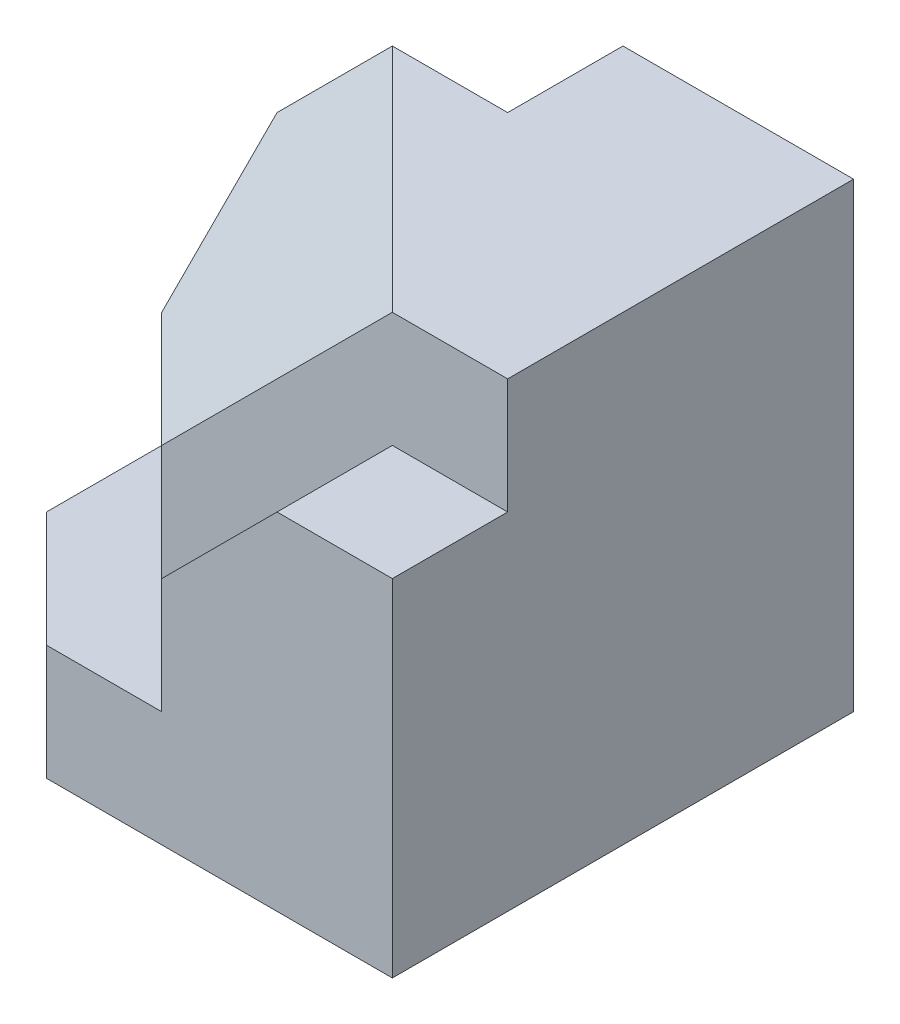
ISO-10303-21;
HEADER;
FILE_DESCRIPTION(('STEP AP214'),'2;1');
FILE_NAME('part.step','',(''),(''),'','','');
FILE_SCHEMA(('AUTOMOTIVE_DESIGN { 1 0 10303 214 1 1 1 1 }'));
ENDSEC;
DATA;
#1=APPLICATION_CONTEXT('core data for automotive mechanical design processes');
#2=APPLICATION_PROTOCOL_DEFINITION('international standard','automotive_design',2000,#1);
#3=PRODUCT_CONTEXT('',#1,'mechanical');
#4=PRODUCT('Part','Part','',(#3));
#5=PRODUCT_RELATED_PRODUCT_CATEGORY('part','',(#4));
#6=PRODUCT_DEFINITION_FORMATION('','',#4);
#7=PRODUCT_DEFINITION_CONTEXT('part definition',#1,'design');
#8=PRODUCT_DEFINITION('design','',#6,#7);
#9=PRODUCT_DEFINITION_SHAPE('','',#8);
#10=(LENGTH_UNIT() NAMED_UNIT(*) SI_UNIT(.MILLI.,.METRE.));
#11=(NAMED_UNIT(*) PLANE_ANGLE_UNIT() SI_UNIT($,.RADIAN.));
#12=(NAMED_UNIT(*) SI_UNIT($,.STERADIAN.) SOLID_ANGLE_UNIT());
#13=UNCERTAINTY_MEASURE_WITH_UNIT(LENGTH_MEASURE(1.E-05),#10,'distance_accuracy_value','');
#14=(GEOMETRIC_REPRESENTATION_CONTEXT(3) GLOBAL_UNCERTAINTY_ASSIGNED_CONTEXT((#13)) GLOBAL_UNIT_ASSIGNED_CONTEXT((#10,
#11,#12)) REPRESENTATION_CONTEXT('',''));
#15=CARTESIAN_POINT('',(0.,0.,0.));
#16=DIRECTION('',(0.,0.,1.));
#17=DIRECTION('',(1.,0.,0.));
#18=AXIS2_PLACEMENT_3D('',#15,#16,#17);
#19=CARTESIAN_POINT('',(-15.,20.,5.));
#20=DIRECTION('',(0.,0.,1.));
#21=DIRECTION('',(1.,0.,0.));
#22=AXIS2_PLACEMENT_3D('',#19,#20,#21);
#23=PLANE('',#22);
#24=DIRECTION('',(1.,0.,0.));
#25=VECTOR('',#24,1.);
#26=CARTESIAN_POINT('',(-20.,15.,5.));
#27=LINE('',#26,#25);
#28=CARTESIAN_POINT('',(-20.,15.,5.));
#29=VERTEX_POINT('',#28);
#30=CARTESIAN_POINT('',(-10.,15.,5.));
#31=VERTEX_POINT('',#30);
#32=EDGE_CURVE('E173',#29,#31,#27,.T.);
#33=ORIENTED_EDGE('',*,*,#32,.F.);
#34=DIRECTION('',(0.707106781186548,0.707106781186548,0.));
#35=VECTOR('',#34,1.);
#36=CARTESIAN_POINT('',(-20.,15.,5.));
#37=LINE('',#36,#35);
#38=CARTESIAN_POINT('',(-15.,20.,5.));
#39=VERTEX_POINT('',#38);
#40=EDGE_CURVE('E149',#29,#39,#37,.T.);
#41=ORIENTED_EDGE('',*,*,#40,.T.);
#42=DIRECTION('',(-1.,0.,0.));
#43=VECTOR('',#42,1.);
#44=CARTESIAN_POINT('',(-15.,20.,5.));
#45=LINE('',#44,#43);
#46=CARTESIAN_POINT('',(-10.,20.,5.));
#47=VERTEX_POINT('',#46);
#48=EDGE_CURVE('E159',#47,#39,#45,.T.);
#49=ORIENTED_EDGE('',*,*,#48,.F.);
#50=DIRECTION('',(0.,-1.,0.));
#51=VECTOR('',#50,1.);
#52=CARTESIAN_POINT('',(-10.,20.,5.));
#53=LINE('',#52,#51);
#54=EDGE_CURVE('E233',#47,#31,#53,.T.);
#55=ORIENTED_EDGE('',*,*,#54,.T.);
#56=EDGE_LOOP('',(#33,#41,#49,#55));
#57=FACE_BOUND('',#56,.T.);
#58=ADVANCED_FACE('F34',(#57),#23,.F.);
#59=CARTESIAN_POINT('',(-10.,20.,5.));
#60=DIRECTION('',(1.,0.,0.));
#61=DIRECTION('',(0.,0.,-1.));
#62=AXIS2_PLACEMENT_3D('',#59,#60,#61);
#63=PLANE('',#62);
#64=DIRECTION('',(0.,0.,-1.));
#65=VECTOR('',#64,1.);
#66=CARTESIAN_POINT('',(-10.,15.,0.));
#67=LINE('',#66,#65);
#68=CARTESIAN_POINT('',(-10.,15.,0.));
#69=VERTEX_POINT('',#68);
#70=EDGE_CURVE('E54',#31,#69,#67,.T.);
#71=ORIENTED_EDGE('',*,*,#70,.F.);
#72=ORIENTED_EDGE('',*,*,#54,.F.);
#73=DIRECTION('',(0.,0.,1.));
#74=VECTOR('',#73,1.);
#75=CARTESIAN_POINT('',(-10.,20.,5.));
#76=LINE('',#75,#74);
#77=CARTESIAN_POINT('',(-10.,20.,0.));
#78=VERTEX_POINT('',#77);
#79=EDGE_CURVE('E283',#78,#47,#76,.T.);
#80=ORIENTED_EDGE('',*,*,#79,.F.);
#81=DIRECTION('',(0.,-1.,0.));
#82=VECTOR('',#81,1.);
#83=CARTESIAN_POINT('',(-10.,20.,0.));
#84=LINE('',#83,#82);
#85=EDGE_CURVE('E50',#78,#69,#84,.T.);
#86=ORIENTED_EDGE('',*,*,#85,.T.);
#87=EDGE_LOOP('',(#71,#72,#80,#86));
#88=FACE_BOUND('',#87,.T.);
#89=ADVANCED_FACE('F332',(#88),#63,.F.);
#90=CARTESIAN_POINT('',(-15.,20.,15.));
#91=DIRECTION('',(-0.707106781186548,0.,0.707106781186547));
#92=DIRECTION('',(0.707106781186547,0.,0.707106781186548));
#93=AXIS2_PLACEMENT_3D('',#90,#91,#92);
#94=PLANE('',#93);
#95=DIRECTION('',(0.,-1.,0.));
#96=VECTOR('',#95,1.);
#97=CARTESIAN_POINT('',(-20.,20.,10.));
#98=LINE('',#97,#96);
#99=CARTESIAN_POINT('',(-20.,10.,10.));
#100=VERTEX_POINT('',#99);
#101=CARTESIAN_POINT('',(-20.,5.,10.));
#102=VERTEX_POINT('',#101);
#103=EDGE_CURVE('E242',#100,#102,#98,.T.);
#104=ORIENTED_EDGE('',*,*,#103,.T.);
#105=DIRECTION('',(0.707106781186547,0.,0.707106781186548));
#106=VECTOR('',#105,1.);
#107=CARTESIAN_POINT('',(-20.,5.,10.));
#108=LINE('',#107,#106);
#109=CARTESIAN_POINT('',(-15.,5.,15.));
#110=VERTEX_POINT('',#109);
#111=EDGE_CURVE('E177',#102,#110,#108,.T.);
#112=ORIENTED_EDGE('',*,*,#111,.T.);
#113=DIRECTION('',(0.,-1.,0.));
#114=VECTOR('',#113,1.);
#115=CARTESIAN_POINT('',(-15.,20.,15.));
#116=LINE('',#115,#114);
#117=CARTESIAN_POINT('',(-15.,10.,15.));
#118=VERTEX_POINT('',#117);
#119=EDGE_CURVE('E148',#118,#110,#116,.T.);
#120=ORIENTED_EDGE('',*,*,#119,.F.);
#121=DIRECTION('',(-0.707106781186547,0.,-0.707106781186548));
#122=VECTOR('',#121,1.);
#123=CARTESIAN_POINT('',(-15.,10.,15.));
#124=LINE('',#123,#122);
#125=EDGE_CURVE('E243',#118,#100,#124,.T.);
#126=ORIENTED_EDGE('',*,*,#125,.T.);
#127=EDGE_LOOP('',(#104,#112,#120,#126));
#128=FACE_BOUND('',#127,.T.);
#129=ADVANCED_FACE('F320',(#128),#94,.T.);
#130=CARTESIAN_POINT('',(0.,20.,15.));
#131=DIRECTION('',(0.,0.,-1.));
#132=DIRECTION('',(-1.,0.,0.));
#133=AXIS2_PLACEMENT_3D('',#130,#131,#132);
#134=PLANE('',#133);
#135=DIRECTION('',(-1.,0.,0.));
#136=VECTOR('',#135,1.);
#137=CARTESIAN_POINT('',(-9.99999999999999,5.,15.));
#138=LINE('',#137,#136);
#139=CARTESIAN_POINT('',(-9.99999999999999,5.,15.));
#140=VERTEX_POINT('',#139);
#141=EDGE_CURVE('E189',#140,#110,#138,.T.);
#142=ORIENTED_EDGE('',*,*,#141,.F.);
#143=DIRECTION('',(0.,-1.,0.));
#144=VECTOR('',#143,1.);
#145=CARTESIAN_POINT('',(-9.99999999999999,10.,15.));
#146=LINE('',#145,#144);
#147=CARTESIAN_POINT('',(-9.99999999999999,10.,15.));
#148=VERTEX_POINT('',#147);
#149=EDGE_CURVE('E208',#148,#140,#146,.T.);
#150=ORIENTED_EDGE('',*,*,#149,.F.);
#151=DIRECTION('',(-0.707106781186548,-0.707106781186547,0.));
#152=VECTOR('',#151,1.);
#153=CARTESIAN_POINT('',(-5.,15.,15.));
#154=LINE('',#153,#152);
#155=CARTESIAN_POINT('',(-5.,15.,15.));
#156=VERTEX_POINT('',#155);
#157=EDGE_CURVE('E205',#156,#148,#154,.T.);
#158=ORIENTED_EDGE('',*,*,#157,.F.);
#159=DIRECTION('',(-1.,0.,0.));
#160=VECTOR('',#159,1.);
#161=CARTESIAN_POINT('',(0.,15.,15.));
#162=LINE('',#161,#160);
#163=CARTESIAN_POINT('',(0.,15.,15.));
#164=VERTEX_POINT('',#163);
#165=EDGE_CURVE('E184',#164,#156,#162,.T.);
#166=ORIENTED_EDGE('',*,*,#165,.F.);
#167=DIRECTION('',(0.,-1.,0.));
#168=VECTOR('',#167,1.);
#169=CARTESIAN_POINT('',(0.,20.,15.));
#170=LINE('',#169,#168);
#171=CARTESIAN_POINT('',(0.,20.,15.));
#172=VERTEX_POINT('',#171);
#173=EDGE_CURVE('E12',#172,#164,#170,.T.);
#174=ORIENTED_EDGE('',*,*,#173,.F.);
#175=DIRECTION('',(1.,0.,0.));
#176=VECTOR('',#175,1.);
#177=CARTESIAN_POINT('',(0.,20.,15.));
#178=LINE('',#177,#176);
#179=CARTESIAN_POINT('',(-5.,20.,15.));
#180=VERTEX_POINT('',#179);
#181=EDGE_CURVE('E274',#180,#172,#178,.T.);
#182=ORIENTED_EDGE('',*,*,#181,.F.);
#183=DIRECTION('',(-0.707106781186548,-0.707106781186547,0.));
#184=VECTOR('',#183,1.);
#185=CARTESIAN_POINT('',(-5.,20.,15.));
#186=LINE('',#185,#184);
#187=EDGE_CURVE('E246',#180,#118,#186,.T.);
#188=ORIENTED_EDGE('',*,*,#187,.T.);
#189=ORIENTED_EDGE('',*,*,#119,.T.);
#190=EDGE_LOOP('',(#142,#150,#158,#166,#174,#182,#188,#189));
#191=FACE_BOUND('',#190,.T.);
#192=ADVANCED_FACE('F315',(#191),#134,.F.);
#193=CARTESIAN_POINT('',(0.,20.,0.));
#194=DIRECTION('',(0.,1.,0.));
#195=DIRECTION('',(0.,0.,1.));
#196=AXIS2_PLACEMENT_3D('',#193,#194,#195);
#197=PLANE('',#196);
#198=ORIENTED_EDGE('',*,*,#48,.T.);
#199=DIRECTION('',(0.707106781186548,0.,0.707106781186548));
#200=VECTOR('',#199,1.);
#201=CARTESIAN_POINT('',(-15.,20.,5.));
#202=LINE('',#201,#200);
#203=EDGE_CURVE('E239',#39,#180,#202,.T.);
#204=ORIENTED_EDGE('',*,*,#203,.T.);
#205=ORIENTED_EDGE('',*,*,#181,.T.);
#206=DIRECTION('',(0.,0.,-1.));
#207=VECTOR('',#206,1.);
#208=CARTESIAN_POINT('',(0.,20.,0.));
#209=LINE('',#208,#207);
#210=CARTESIAN_POINT('',(0.,20.,0.));
#211=VERTEX_POINT('',#210);
#212=EDGE_CURVE('E279',#172,#211,#209,.T.);
#213=ORIENTED_EDGE('',*,*,#212,.T.);
#214=DIRECTION('',(-1.,0.,0.));
#215=VECTOR('',#214,1.);
#216=CARTESIAN_POINT('',(-10.,20.,0.));
#217=LINE('',#216,#215);
#218=EDGE_CURVE('E281',#211,#78,#217,.T.);
#219=ORIENTED_EDGE('',*,*,#218,.T.);
#220=ORIENTED_EDGE('',*,*,#79,.T.);
#221=EDGE_LOOP('',(#198,#204,#205,#213,#219,#220));
#222=FACE_BOUND('',#221,.T.);
#223=ADVANCED_FACE('F331',(#222),#197,.T.);
#224=CARTESIAN_POINT('',(-20.,20.,10.));
#225=DIRECTION('',(-1.,0.,0.));
#226=DIRECTION('',(0.,0.,1.));
#227=AXIS2_PLACEMENT_3D('',#224,#225,#226);
#228=PLANE('',#227);
#229=ORIENTED_EDGE('',*,*,#103,.F.);
#230=DIRECTION('',(0.,0.707106781186548,-0.707106781186548));
#231=VECTOR('',#230,1.);
#232=CARTESIAN_POINT('',(-20.,10.,10.));
#233=LINE('',#232,#231);
#234=EDGE_CURVE('E236',#100,#29,#233,.T.);
#235=ORIENTED_EDGE('',*,*,#234,.T.);
#236=DIRECTION('',(0.,0.,-1.));
#237=VECTOR('',#236,1.);
#238=CARTESIAN_POINT('',(-20.,15.,0.));
#239=LINE('',#238,#237);
#240=CARTESIAN_POINT('',(-20.,15.,0.));
#241=VERTEX_POINT('',#240);
#242=EDGE_CURVE('E166',#29,#241,#239,.T.);
#243=ORIENTED_EDGE('',*,*,#242,.T.);
#244=DIRECTION('',(0.,-1.,0.));
#245=VECTOR('',#244,1.);
#246=CARTESIAN_POINT('',(-20.,0.,0.));
#247=LINE('',#246,#245);
#248=CARTESIAN_POINT('',(-20.,0.,0.));
#249=VERTEX_POINT('',#248);
#250=EDGE_CURVE('E156',#241,#249,#247,.T.);
#251=ORIENTED_EDGE('',*,*,#250,.T.);
#252=DIRECTION('',(0.,0.,-1.));
#253=VECTOR('',#252,1.);
#254=CARTESIAN_POINT('',(-20.,0.,10.));
#255=LINE('',#254,#253);
#256=CARTESIAN_POINT('',(-20.,0.,15.));
#257=VERTEX_POINT('',#256);
#258=EDGE_CURVE('E139',#257,#249,#255,.T.);
#259=ORIENTED_EDGE('',*,*,#258,.F.);
#260=DIRECTION('',(0.,-1.,0.));
#261=VECTOR('',#260,1.);
#262=CARTESIAN_POINT('',(-20.,5.,15.));
#263=LINE('',#262,#261);
#264=CARTESIAN_POINT('',(-20.,5.,15.));
#265=VERTEX_POINT('',#264);
#266=EDGE_CURVE('E181',#265,#257,#263,.T.);
#267=ORIENTED_EDGE('',*,*,#266,.F.);
#268=DIRECTION('',(0.,0.,-1.));
#269=VECTOR('',#268,1.);
#270=CARTESIAN_POINT('',(-20.,5.,15.));
#271=LINE('',#270,#269);
#272=EDGE_CURVE('E174',#265,#102,#271,.T.);
#273=ORIENTED_EDGE('',*,*,#272,.T.);
#274=EDGE_LOOP('',(#229,#235,#243,#251,#259,#267,#273));
#275=FACE_BOUND('',#274,.T.);
#276=ADVANCED_FACE('F163',(#275),#228,.T.);
#277=CARTESIAN_POINT('',(0.,20.,0.));
#278=DIRECTION('',(-1.,0.,0.));
#279=DIRECTION('',(0.,0.,1.));
#280=AXIS2_PLACEMENT_3D('',#277,#278,#279);
#281=PLANE('',#280);
#282=DIRECTION('',(0.,0.,-1.));
#283=VECTOR('',#282,1.);
#284=CARTESIAN_POINT('',(0.,0.,0.));
#285=LINE('',#284,#283);
#286=CARTESIAN_POINT('',(0.,0.,20.));
#287=VERTEX_POINT('',#286);
#288=CARTESIAN_POINT('',(0.,0.,0.));
#289=VERTEX_POINT('',#288);
#290=EDGE_CURVE('E160',#287,#289,#285,.T.);
#291=ORIENTED_EDGE('',*,*,#290,.T.);
#292=DIRECTION('',(0.,-1.,0.));
#293=VECTOR('',#292,1.);
#294=CARTESIAN_POINT('',(0.,20.,0.));
#295=LINE('',#294,#293);
#296=EDGE_CURVE('E42',#211,#289,#295,.T.);
#297=ORIENTED_EDGE('',*,*,#296,.F.);
#298=ORIENTED_EDGE('',*,*,#212,.F.);
#299=ORIENTED_EDGE('',*,*,#173,.T.);
#300=DIRECTION('',(0.,0.,-1.));
#301=VECTOR('',#300,1.);
#302=CARTESIAN_POINT('',(0.,15.,20.));
#303=LINE('',#302,#301);
#304=CARTESIAN_POINT('',(0.,15.,20.));
#305=VERTEX_POINT('',#304);
#306=EDGE_CURVE('E244',#305,#164,#303,.T.);
#307=ORIENTED_EDGE('',*,*,#306,.F.);
#308=DIRECTION('',(0.,1.,0.));
#309=VECTOR('',#308,1.);
#310=CARTESIAN_POINT('',(0.,0.,20.));
#311=LINE('',#310,#309);
#312=EDGE_CURVE('E185',#287,#305,#311,.T.);
#313=ORIENTED_EDGE('',*,*,#312,.F.);
#314=EDGE_LOOP('',(#291,#297,#298,#299,#307,#313));
#315=FACE_BOUND('',#314,.T.);
#316=ADVANCED_FACE('F328',(#315),#281,.F.);
#317=CARTESIAN_POINT('',(-10.,20.,0.));
#318=DIRECTION('',(0.,0.,1.));
#319=DIRECTION('',(1.,0.,0.));
#320=AXIS2_PLACEMENT_3D('',#317,#318,#319);
#321=PLANE('',#320);
#322=DIRECTION('',(-1.,0.,0.));
#323=VECTOR('',#322,1.);
#324=CARTESIAN_POINT('',(-10.,0.,0.));
#325=LINE('',#324,#323);
#326=EDGE_CURVE('E142',#289,#249,#325,.T.);
#327=ORIENTED_EDGE('',*,*,#326,.T.);
#328=ORIENTED_EDGE('',*,*,#250,.F.);
#329=DIRECTION('',(1.,0.,0.));
#330=VECTOR('',#329,1.);
#331=CARTESIAN_POINT('',(-20.,15.,0.));
#332=LINE('',#331,#330);
#333=EDGE_CURVE('E169',#241,#69,#332,.T.);
#334=ORIENTED_EDGE('',*,*,#333,.T.);
#335=ORIENTED_EDGE('',*,*,#85,.F.);
#336=ORIENTED_EDGE('',*,*,#218,.F.);
#337=ORIENTED_EDGE('',*,*,#296,.T.);
#338=EDGE_LOOP('',(#327,#328,#334,#335,#336,#337));
#339=FACE_BOUND('',#338,.T.);
#340=ADVANCED_FACE('F154',(#339),#321,.F.);
#341=CARTESIAN_POINT('',(0.,0.,0.));
#342=DIRECTION('',(0.,1.,0.));
#343=DIRECTION('',(0.,0.,1.));
#344=AXIS2_PLACEMENT_3D('',#341,#342,#343);
#345=PLANE('',#344);
#346=ORIENTED_EDGE('',*,*,#258,.T.);
#347=ORIENTED_EDGE('',*,*,#326,.F.);
#348=ORIENTED_EDGE('',*,*,#290,.F.);
#349=DIRECTION('',(1.,0.,0.));
#350=VECTOR('',#349,1.);
#351=CARTESIAN_POINT('',(-15.,0.,20.));
#352=LINE('',#351,#350);
#353=CARTESIAN_POINT('',(-15.,0.,20.));
#354=VERTEX_POINT('',#353);
#355=EDGE_CURVE('E201',#354,#287,#352,.T.);
#356=ORIENTED_EDGE('',*,*,#355,.F.);
#357=DIRECTION('',(-0.707106781186548,0.,-0.707106781186548));
#358=VECTOR('',#357,1.);
#359=CARTESIAN_POINT('',(-15.,0.,20.));
#360=LINE('',#359,#358);
#361=EDGE_CURVE('E144',#354,#257,#360,.T.);
#362=ORIENTED_EDGE('',*,*,#361,.T.);
#363=EDGE_LOOP('',(#346,#347,#348,#356,#362));
#364=FACE_BOUND('',#363,.T.);
#365=ADVANCED_FACE('F141',(#364),#345,.F.);
#366=CARTESIAN_POINT('',(-13.3333333333333,13.3333333333333,13.3333333333333));
#367=DIRECTION('',(-0.577350269189626,0.577350269189626,0.577350269189626));
#368=DIRECTION('',(0.,-0.707106781186547,0.707106781186548));
#369=AXIS2_PLACEMENT_3D('',#366,#367,#368);
#370=PLANE('',#369);
#371=ORIENTED_EDGE('',*,*,#40,.F.);
#372=ORIENTED_EDGE('',*,*,#234,.F.);
#373=ORIENTED_EDGE('',*,*,#125,.F.);
#374=ORIENTED_EDGE('',*,*,#187,.F.);
#375=ORIENTED_EDGE('',*,*,#203,.F.);
#376=EDGE_LOOP('',(#371,#372,#373,#374,#375));
#377=FACE_BOUND('',#376,.T.);
#378=ADVANCED_FACE('F235',(#377),#370,.T.);
#379=CARTESIAN_POINT('',(0.,15.,20.));
#380=DIRECTION('',(0.,-1.,0.));
#381=DIRECTION('',(1.,0.,0.));
#382=AXIS2_PLACEMENT_3D('',#379,#380,#381);
#383=PLANE('',#382);
#384=ORIENTED_EDGE('',*,*,#165,.T.);
#385=DIRECTION('',(0.,0.,-1.));
#386=VECTOR('',#385,1.);
#387=CARTESIAN_POINT('',(-5.,15.,20.));
#388=LINE('',#387,#386);
#389=CARTESIAN_POINT('',(-5.,15.,20.));
#390=VERTEX_POINT('',#389);
#391=EDGE_CURVE('E249',#390,#156,#388,.T.);
#392=ORIENTED_EDGE('',*,*,#391,.F.);
#393=DIRECTION('',(-1.,0.,0.));
#394=VECTOR('',#393,1.);
#395=CARTESIAN_POINT('',(0.,15.,20.));
#396=LINE('',#395,#394);
#397=EDGE_CURVE('E188',#305,#390,#396,.T.);
#398=ORIENTED_EDGE('',*,*,#397,.F.);
#399=ORIENTED_EDGE('',*,*,#306,.T.);
#400=EDGE_LOOP('',(#384,#392,#398,#399));
#401=FACE_BOUND('',#400,.T.);
#402=ADVANCED_FACE('F296',(#401),#383,.F.);
#403=CARTESIAN_POINT('',(-5.,15.,20.));
#404=DIRECTION('',(0.707106781186547,-0.707106781186548,0.));
#405=DIRECTION('',(0.707106781186548,0.707106781186547,0.));
#406=AXIS2_PLACEMENT_3D('',#403,#404,#405);
#407=PLANE('',#406);
#408=ORIENTED_EDGE('',*,*,#157,.T.);
#409=DIRECTION('',(0.,0.,-1.));
#410=VECTOR('',#409,1.);
#411=CARTESIAN_POINT('',(-9.99999999999999,10.,20.));
#412=LINE('',#411,#410);
#413=CARTESIAN_POINT('',(-9.99999999999999,10.,20.));
#414=VERTEX_POINT('',#413);
#415=EDGE_CURVE('E305',#414,#148,#412,.T.);
#416=ORIENTED_EDGE('',*,*,#415,.F.);
#417=DIRECTION('',(-0.707106781186548,-0.707106781186547,0.));
#418=VECTOR('',#417,1.);
#419=CARTESIAN_POINT('',(-5.,15.,20.));
#420=LINE('',#419,#418);
#421=EDGE_CURVE('E191',#390,#414,#420,.T.);
#422=ORIENTED_EDGE('',*,*,#421,.F.);
#423=ORIENTED_EDGE('',*,*,#391,.T.);
#424=EDGE_LOOP('',(#408,#416,#422,#423));
#425=FACE_BOUND('',#424,.T.);
#426=ADVANCED_FACE('F302',(#425),#407,.F.);
#427=CARTESIAN_POINT('',(-9.99999999999999,10.,20.));
#428=DIRECTION('',(1.,0.,0.));
#429=DIRECTION('',(0.,0.,-1.));
#430=AXIS2_PLACEMENT_3D('',#427,#428,#429);
#431=PLANE('',#430);
#432=ORIENTED_EDGE('',*,*,#149,.T.);
#433=DIRECTION('',(0.,0.,-1.));
#434=VECTOR('',#433,1.);
#435=CARTESIAN_POINT('',(-9.99999999999999,5.,20.));
#436=LINE('',#435,#434);
#437=CARTESIAN_POINT('',(-9.99999999999999,5.,20.));
#438=VERTEX_POINT('',#437);
#439=EDGE_CURVE('E204',#438,#140,#436,.T.);
#440=ORIENTED_EDGE('',*,*,#439,.F.);
#441=DIRECTION('',(0.,-1.,0.));
#442=VECTOR('',#441,1.);
#443=CARTESIAN_POINT('',(-9.99999999999999,10.,20.));
#444=LINE('',#443,#442);
#445=EDGE_CURVE('E193',#414,#438,#444,.T.);
#446=ORIENTED_EDGE('',*,*,#445,.F.);
#447=ORIENTED_EDGE('',*,*,#415,.T.);
#448=EDGE_LOOP('',(#432,#440,#446,#447));
#449=FACE_BOUND('',#448,.T.);
#450=ADVANCED_FACE('F314',(#449),#431,.F.);
#451=CARTESIAN_POINT('',(-9.99999999999999,5.,20.));
#452=DIRECTION('',(0.,-1.,0.));
#453=DIRECTION('',(1.,0.,0.));
#454=AXIS2_PLACEMENT_3D('',#451,#452,#453);
#455=PLANE('',#454);
#456=ORIENTED_EDGE('',*,*,#141,.T.);
#457=ORIENTED_EDGE('',*,*,#111,.F.);
#458=ORIENTED_EDGE('',*,*,#272,.F.);
#459=DIRECTION('',(-0.707106781186548,0.,-0.707106781186548));
#460=VECTOR('',#459,1.);
#461=CARTESIAN_POINT('',(-15.,5.,20.));
#462=LINE('',#461,#460);
#463=CARTESIAN_POINT('',(-15.,5.,20.));
#464=VERTEX_POINT('',#463);
#465=EDGE_CURVE('E178',#464,#265,#462,.T.);
#466=ORIENTED_EDGE('',*,*,#465,.F.);
#467=DIRECTION('',(-1.,0.,0.));
#468=VECTOR('',#467,1.);
#469=CARTESIAN_POINT('',(-9.99999999999999,5.,20.));
#470=LINE('',#469,#468);
#471=EDGE_CURVE('E195',#438,#464,#470,.T.);
#472=ORIENTED_EDGE('',*,*,#471,.F.);
#473=ORIENTED_EDGE('',*,*,#439,.T.);
#474=EDGE_LOOP('',(#456,#457,#458,#466,#472,#473));
#475=FACE_BOUND('',#474,.T.);
#476=ADVANCED_FACE('F312',(#475),#455,.F.);
#477=CARTESIAN_POINT('',(0.,0.,20.));
#478=DIRECTION('',(0.,0.,1.));
#479=DIRECTION('',(1.,0.,0.));
#480=AXIS2_PLACEMENT_3D('',#477,#478,#479);
#481=PLANE('',#480);
#482=ORIENTED_EDGE('',*,*,#312,.T.);
#483=ORIENTED_EDGE('',*,*,#397,.T.);
#484=ORIENTED_EDGE('',*,*,#421,.T.);
#485=ORIENTED_EDGE('',*,*,#445,.T.);
#486=ORIENTED_EDGE('',*,*,#471,.T.);
#487=DIRECTION('',(0.,-1.,0.));
#488=VECTOR('',#487,1.);
#489=CARTESIAN_POINT('',(-15.,5.,20.));
#490=LINE('',#489,#488);
#491=EDGE_CURVE('E198',#464,#354,#490,.T.);
#492=ORIENTED_EDGE('',*,*,#491,.T.);
#493=ORIENTED_EDGE('',*,*,#355,.T.);
#494=EDGE_LOOP('',(#482,#483,#484,#485,#486,#492,#493));
#495=FACE_BOUND('',#494,.T.);
#496=ADVANCED_FACE('F325',(#495),#481,.T.);
#497=CARTESIAN_POINT('',(-15.,5.,20.));
#498=DIRECTION('',(-0.707106781186548,0.,0.707106781186548));
#499=DIRECTION('',(0.707106781186548,0.,0.707106781186548));
#500=AXIS2_PLACEMENT_3D('',#497,#498,#499);
#501=PLANE('',#500);
#502=ORIENTED_EDGE('',*,*,#361,.F.);
#503=ORIENTED_EDGE('',*,*,#491,.F.);
#504=ORIENTED_EDGE('',*,*,#465,.T.);
#505=ORIENTED_EDGE('',*,*,#266,.T.);
#506=EDGE_LOOP('',(#502,#503,#504,#505));
#507=FACE_BOUND('',#506,.T.);
#508=ADVANCED_FACE('F323',(#507),#501,.T.);
#509=CARTESIAN_POINT('',(-20.,15.,0.));
#510=DIRECTION('',(0.,-1.,0.));
#511=DIRECTION('',(0.,0.,-1.));
#512=AXIS2_PLACEMENT_3D('',#509,#510,#511);
#513=PLANE('',#512);
#514=ORIENTED_EDGE('',*,*,#70,.T.);
#515=ORIENTED_EDGE('',*,*,#333,.F.);
#516=ORIENTED_EDGE('',*,*,#242,.F.);
#517=ORIENTED_EDGE('',*,*,#32,.T.);
#518=EDGE_LOOP('',(#514,#515,#516,#517));
#519=FACE_BOUND('',#518,.T.);
#520=ADVANCED_FACE('F227',(#519),#513,.F.);
#521=CLOSED_SHELL('',(#58,#89,#129,#192,#223,#276,#316,#340,#365,#378,#402,#426,#450,#476,#496,
#508,#520));
#522=MANIFOLD_SOLID_BREP('B2',#521);
#523=ADVANCED_BREP_SHAPE_REPRESENTATION('',(#18,#522),#14);
#524=SHAPE_DEFINITION_REPRESENTATION(#9,#523);
ENDSEC;
END-ISO-10303-21;
